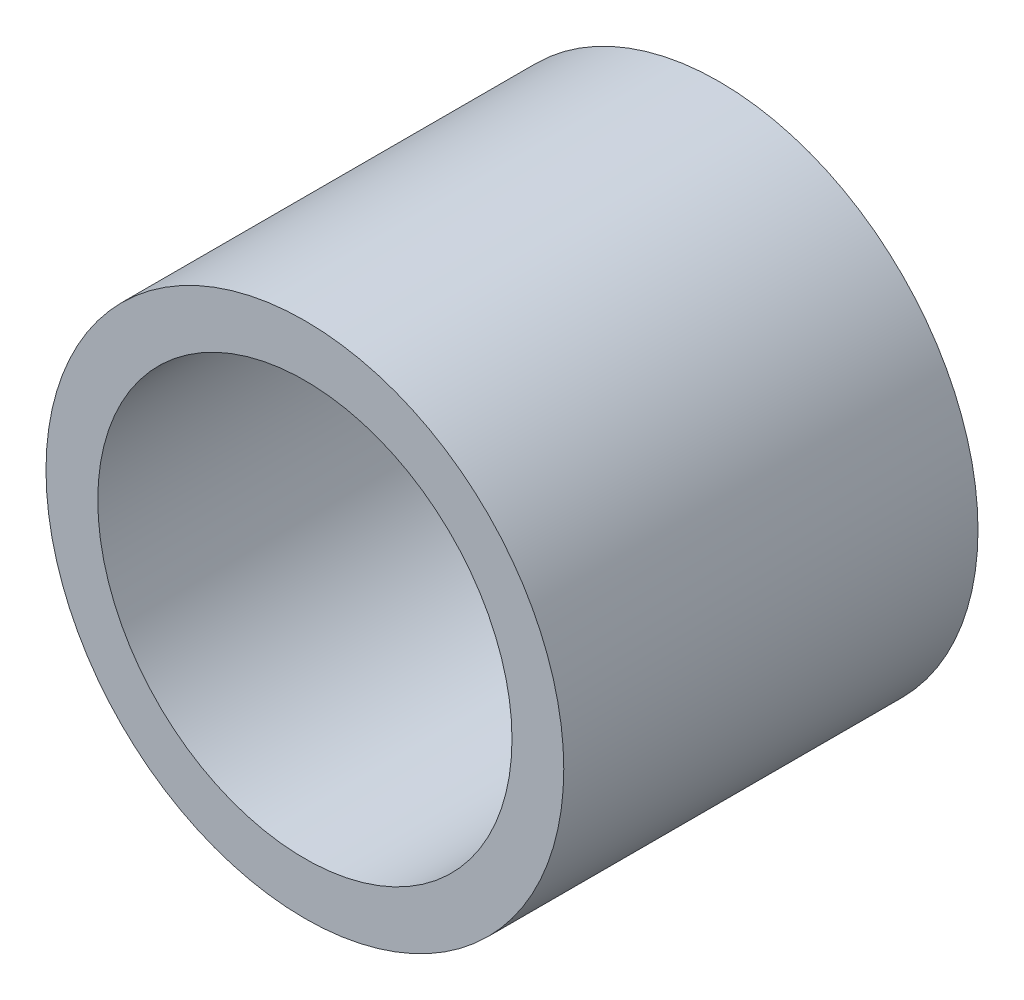
ISO-10303-21;
HEADER;
FILE_DESCRIPTION(('STEP AP214'),'2;1');
FILE_NAME('part.step','',(''),(''),'','','');
FILE_SCHEMA(('AUTOMOTIVE_DESIGN { 1 0 10303 214 1 1 1 1 }'));
ENDSEC;
DATA;
#1=APPLICATION_CONTEXT('core data for automotive mechanical design processes');
#2=APPLICATION_PROTOCOL_DEFINITION('international standard','automotive_design',2000,#1);
#3=PRODUCT_CONTEXT('',#1,'mechanical');
#4=PRODUCT('Part','Part','',(#3));
#5=PRODUCT_RELATED_PRODUCT_CATEGORY('part','',(#4));
#6=PRODUCT_DEFINITION_FORMATION('','',#4);
#7=PRODUCT_DEFINITION_CONTEXT('part definition',#1,'design');
#8=PRODUCT_DEFINITION('design','',#6,#7);
#9=PRODUCT_DEFINITION_SHAPE('','',#8);
#10=(LENGTH_UNIT() NAMED_UNIT(*) SI_UNIT(.MILLI.,.METRE.));
#11=(NAMED_UNIT(*) PLANE_ANGLE_UNIT() SI_UNIT($,.RADIAN.));
#12=(NAMED_UNIT(*) SI_UNIT($,.STERADIAN.) SOLID_ANGLE_UNIT());
#13=UNCERTAINTY_MEASURE_WITH_UNIT(LENGTH_MEASURE(1.E-05),#10,'distance_accuracy_value','');
#14=(GEOMETRIC_REPRESENTATION_CONTEXT(3) GLOBAL_UNCERTAINTY_ASSIGNED_CONTEXT((#13)) GLOBAL_UNIT_ASSIGNED_CONTEXT((#10,
#11,#12)) REPRESENTATION_CONTEXT('',''));
#15=CARTESIAN_POINT('',(0.,0.,0.));
#16=DIRECTION('',(0.,0.,1.));
#17=DIRECTION('',(1.,0.,0.));
#18=AXIS2_PLACEMENT_3D('',#15,#16,#17);
#19=CARTESIAN_POINT('',(0.,0.,2.));
#20=DIRECTION('',(0.,0.,1.));
#21=DIRECTION('',(1.,0.,0.));
#22=AXIS2_PLACEMENT_3D('',#19,#20,#21);
#23=PLANE('',#22);
#24=CARTESIAN_POINT('',(0.,0.,2.));
#25=DIRECTION('',(0.,0.,1.));
#26=DIRECTION('',(1.,0.,0.));
#27=AXIS2_PLACEMENT_3D('',#24,#25,#26);
#28=CIRCLE('',#27,1.25);
#29=CARTESIAN_POINT('',(1.25,0.,2.));
#30=VERTEX_POINT('',#29);
#31=EDGE_CURVE('E10',#30,#30,#28,.T.);
#32=ORIENTED_EDGE('',*,*,#31,.T.);
#33=EDGE_LOOP('',(#32));
#34=FACE_BOUND('',#33,.T.);
#35=CARTESIAN_POINT('',(0.,0.,2.));
#36=DIRECTION('',(0.,0.,1.));
#37=DIRECTION('',(1.,0.,0.));
#38=AXIS2_PLACEMENT_3D('',#35,#36,#37);
#39=CIRCLE('',#38,1.);
#40=CARTESIAN_POINT('',(1.,0.,2.));
#41=VERTEX_POINT('',#40);
#42=EDGE_CURVE('E44',#41,#41,#39,.T.);
#43=ORIENTED_EDGE('',*,*,#42,.F.);
#44=EDGE_LOOP('',(#43));
#45=FACE_BOUND('',#44,.T.);
#46=ADVANCED_FACE('F33',(#34,#45),#23,.T.);
#47=CARTESIAN_POINT('',(0.,0.,0.));
#48=DIRECTION('',(0.,0.,1.));
#49=DIRECTION('',(1.,0.,0.));
#50=AXIS2_PLACEMENT_3D('',#47,#48,#49);
#51=PLANE('',#50);
#52=CARTESIAN_POINT('',(0.,0.,0.));
#53=DIRECTION('',(0.,0.,1.));
#54=DIRECTION('',(1.,0.,0.));
#55=AXIS2_PLACEMENT_3D('',#52,#53,#54);
#56=CIRCLE('',#55,1.25);
#57=CARTESIAN_POINT('',(1.25,0.,0.));
#58=VERTEX_POINT('',#57);
#59=EDGE_CURVE('E37',#58,#58,#56,.T.);
#60=ORIENTED_EDGE('',*,*,#59,.F.);
#61=EDGE_LOOP('',(#60));
#62=FACE_BOUND('',#61,.T.);
#63=CARTESIAN_POINT('',(0.,0.,0.));
#64=DIRECTION('',(0.,0.,1.));
#65=DIRECTION('',(1.,0.,0.));
#66=AXIS2_PLACEMENT_3D('',#63,#64,#65);
#67=CIRCLE('',#66,1.);
#68=CARTESIAN_POINT('',(1.,0.,0.));
#69=VERTEX_POINT('',#68);
#70=EDGE_CURVE('E46',#69,#69,#67,.T.);
#71=ORIENTED_EDGE('',*,*,#70,.T.);
#72=EDGE_LOOP('',(#71));
#73=FACE_BOUND('',#72,.T.);
#74=ADVANCED_FACE('F56',(#62,#73),#51,.F.);
#75=CARTESIAN_POINT('',(0.,0.,2.));
#76=DIRECTION('',(0.,0.,-1.));
#77=DIRECTION('',(-1.,0.,0.));
#78=AXIS2_PLACEMENT_3D('',#75,#76,#77);
#79=CYLINDRICAL_SURFACE('',#78,1.25);
#80=ORIENTED_EDGE('',*,*,#31,.F.);
#81=EDGE_LOOP('',(#80));
#82=FACE_BOUND('',#81,.T.);
#83=ORIENTED_EDGE('',*,*,#59,.T.);
#84=EDGE_LOOP('',(#83));
#85=FACE_BOUND('',#84,.T.);
#86=ADVANCED_FACE('F35',(#82,#85),#79,.T.);
#87=CARTESIAN_POINT('',(0.,0.,2.));
#88=DIRECTION('',(0.,0.,-1.));
#89=DIRECTION('',(-1.,0.,0.));
#90=AXIS2_PLACEMENT_3D('',#87,#88,#89);
#91=CYLINDRICAL_SURFACE('',#90,1.);
#92=ORIENTED_EDGE('',*,*,#42,.T.);
#93=EDGE_LOOP('',(#92));
#94=FACE_BOUND('',#93,.T.);
#95=ORIENTED_EDGE('',*,*,#70,.F.);
#96=EDGE_LOOP('',(#95));
#97=FACE_BOUND('',#96,.T.);
#98=ADVANCED_FACE('F52',(#94,#97),#91,.F.);
#99=CLOSED_SHELL('',(#46,#74,#86,#98));
#100=MANIFOLD_SOLID_BREP('B2',#99);
#101=ADVANCED_BREP_SHAPE_REPRESENTATION('',(#18,#100),#14);
#102=SHAPE_DEFINITION_REPRESENTATION(#9,#101);
ENDSEC;
END-ISO-10303-21;
